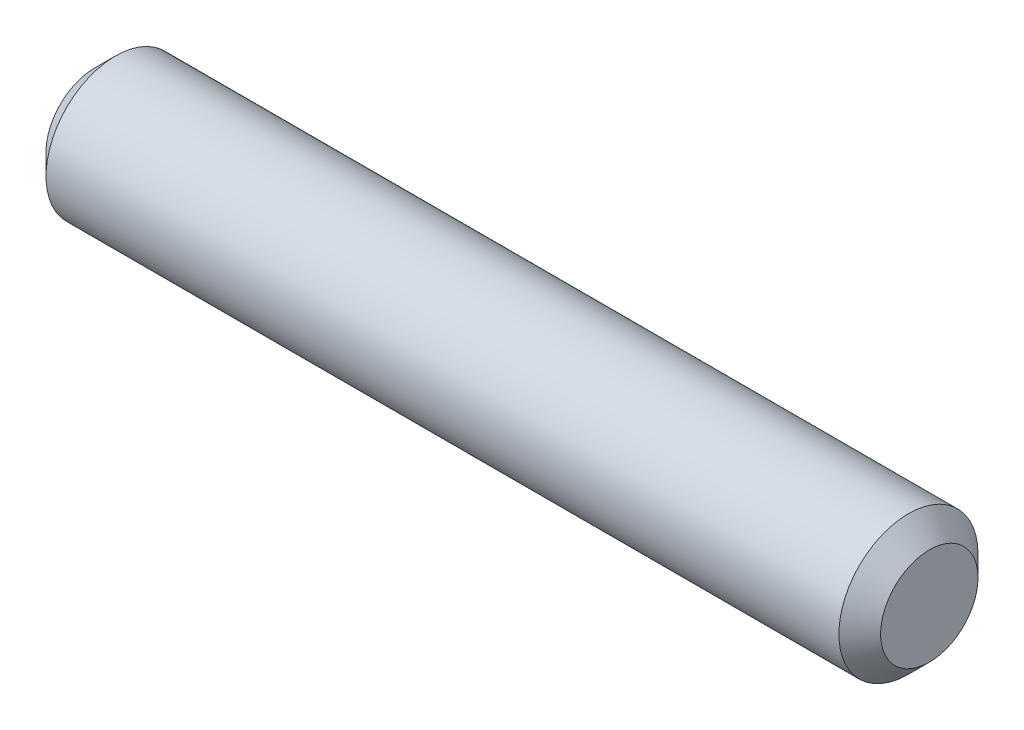
ISO-10303-21;
HEADER;
FILE_DESCRIPTION(('STEP AP214'),'2;1');
FILE_NAME('part.step','',(''),(''),'','','');
FILE_SCHEMA(('AUTOMOTIVE_DESIGN { 1 0 10303 214 1 1 1 1 }'));
ENDSEC;
DATA;
#1=APPLICATION_CONTEXT('core data for automotive mechanical design processes');
#2=APPLICATION_PROTOCOL_DEFINITION('international standard','automotive_design',2000,#1);
#3=PRODUCT_CONTEXT('',#1,'mechanical');
#4=PRODUCT('Part','Part','',(#3));
#5=PRODUCT_RELATED_PRODUCT_CATEGORY('part','',(#4));
#6=PRODUCT_DEFINITION_FORMATION('','',#4);
#7=PRODUCT_DEFINITION_CONTEXT('part definition',#1,'design');
#8=PRODUCT_DEFINITION('design','',#6,#7);
#9=PRODUCT_DEFINITION_SHAPE('','',#8);
#10=(LENGTH_UNIT() NAMED_UNIT(*) SI_UNIT(.MILLI.,.METRE.));
#11=(NAMED_UNIT(*) PLANE_ANGLE_UNIT() SI_UNIT($,.RADIAN.));
#12=(NAMED_UNIT(*) SI_UNIT($,.STERADIAN.) SOLID_ANGLE_UNIT());
#13=UNCERTAINTY_MEASURE_WITH_UNIT(LENGTH_MEASURE(1.E-05),#10,'distance_accuracy_value','');
#14=(GEOMETRIC_REPRESENTATION_CONTEXT(3) GLOBAL_UNCERTAINTY_ASSIGNED_CONTEXT((#13)) GLOBAL_UNIT_ASSIGNED_CONTEXT((#10,
#11,#12)) REPRESENTATION_CONTEXT('',''));
#15=CARTESIAN_POINT('',(0.,0.,0.));
#16=DIRECTION('',(0.,0.,1.));
#17=DIRECTION('',(1.,0.,0.));
#18=AXIS2_PLACEMENT_3D('',#15,#16,#17);
#19=CARTESIAN_POINT('',(-19.05,0.,0.));
#20=DIRECTION('',(1.,0.,0.));
#21=DIRECTION('',(0.,0.,-1.));
#22=AXIS2_PLACEMENT_3D('',#19,#20,#21);
#23=CYLINDRICAL_SURFACE('',#22,3.17499999999999);
#24=CARTESIAN_POINT('',(-18.0975,0.,0.));
#25=DIRECTION('',(1.,0.,0.));
#26=DIRECTION('',(0.,0.,-1.));
#27=AXIS2_PLACEMENT_3D('',#24,#25,#26);
#28=CIRCLE('',#27,3.17499999999999);
#29=CARTESIAN_POINT('',(-18.0975,0.,-3.17499999999999));
#30=VERTEX_POINT('',#29);
#31=EDGE_CURVE('E45',#30,#30,#28,.T.);
#32=ORIENTED_EDGE('',*,*,#31,.T.);
#33=EDGE_LOOP('',(#32));
#34=FACE_BOUND('',#33,.T.);
#35=CARTESIAN_POINT('',(18.0975,0.,0.));
#36=DIRECTION('',(1.,0.,0.));
#37=DIRECTION('',(0.,0.,-1.));
#38=AXIS2_PLACEMENT_3D('',#35,#36,#37);
#39=CIRCLE('',#38,3.17499999999999);
#40=CARTESIAN_POINT('',(18.0975,0.,-3.17499999999999));
#41=VERTEX_POINT('',#40);
#42=EDGE_CURVE('E49',#41,#41,#39,.F.);
#43=ORIENTED_EDGE('',*,*,#42,.T.);
#44=EDGE_LOOP('',(#43));
#45=FACE_BOUND('',#44,.T.);
#46=ADVANCED_FACE('F34',(#34,#45),#23,.T.);
#47=CARTESIAN_POINT('',(-19.05,0.,0.));
#48=DIRECTION('',(1.,0.,0.));
#49=DIRECTION('',(0.,0.,-1.));
#50=AXIS2_PLACEMENT_3D('',#47,#48,#49);
#51=PLANE('',#50);
#52=CARTESIAN_POINT('',(-19.05,0.,0.));
#53=DIRECTION('',(1.,0.,0.));
#54=DIRECTION('',(0.,0.,-1.));
#55=AXIS2_PLACEMENT_3D('',#52,#53,#54);
#56=CIRCLE('',#55,2.22249999999997);
#57=CARTESIAN_POINT('',(-19.05,0.,-2.22249999999997));
#58=VERTEX_POINT('',#57);
#59=EDGE_CURVE('E41',#58,#58,#56,.F.);
#60=ORIENTED_EDGE('',*,*,#59,.T.);
#61=EDGE_LOOP('',(#60));
#62=FACE_BOUND('',#61,.T.);
#63=ADVANCED_FACE('F65',(#62),#51,.F.);
#64=CARTESIAN_POINT('',(19.05,0.,0.));
#65=DIRECTION('',(1.,0.,0.));
#66=DIRECTION('',(0.,0.,-1.));
#67=AXIS2_PLACEMENT_3D('',#64,#65,#66);
#68=PLANE('',#67);
#69=CARTESIAN_POINT('',(19.05,0.,0.));
#70=DIRECTION('',(1.,0.,0.));
#71=DIRECTION('',(0.,0.,-1.));
#72=AXIS2_PLACEMENT_3D('',#69,#70,#71);
#73=CIRCLE('',#72,2.22249999999999);
#74=CARTESIAN_POINT('',(19.05,0.,-2.22249999999999));
#75=VERTEX_POINT('',#74);
#76=EDGE_CURVE('E10',#75,#75,#73,.T.);
#77=ORIENTED_EDGE('',*,*,#76,.T.);
#78=EDGE_LOOP('',(#77));
#79=FACE_BOUND('',#78,.T.);
#80=ADVANCED_FACE('F62',(#79),#68,.T.);
#81=CARTESIAN_POINT('',(-18.0975,0.,0.));
#82=DIRECTION('',(1.,0.,0.));
#83=DIRECTION('',(0.,0.,-1.));
#84=AXIS2_PLACEMENT_3D('',#81,#82,#83);
#85=CONICAL_SURFACE('',#84,3.17499999999999,0.785398163397451);
#86=ORIENTED_EDGE('',*,*,#59,.F.);
#87=EDGE_LOOP('',(#86));
#88=FACE_BOUND('',#87,.T.);
#89=ORIENTED_EDGE('',*,*,#31,.F.);
#90=EDGE_LOOP('',(#89));
#91=FACE_BOUND('',#90,.T.);
#92=ADVANCED_FACE('F58',(#88,#91),#85,.T.);
#93=CARTESIAN_POINT('',(19.05,0.,0.));
#94=DIRECTION('',(-1.,0.,0.));
#95=DIRECTION('',(0.,0.,1.));
#96=AXIS2_PLACEMENT_3D('',#93,#94,#95);
#97=CONICAL_SURFACE('',#96,2.22249999999999,0.785398163397453);
#98=ORIENTED_EDGE('',*,*,#42,.F.);
#99=EDGE_LOOP('',(#98));
#100=FACE_BOUND('',#99,.T.);
#101=ORIENTED_EDGE('',*,*,#76,.F.);
#102=EDGE_LOOP('',(#101));
#103=FACE_BOUND('',#102,.T.);
#104=ADVANCED_FACE('F36',(#100,#103),#97,.T.);
#105=CLOSED_SHELL('',(#46,#63,#80,#92,#104));
#106=MANIFOLD_SOLID_BREP('B2',#105);
#107=ADVANCED_BREP_SHAPE_REPRESENTATION('',(#18,#106),#14);
#108=SHAPE_DEFINITION_REPRESENTATION(#9,#107);
ENDSEC;
END-ISO-10303-21;
